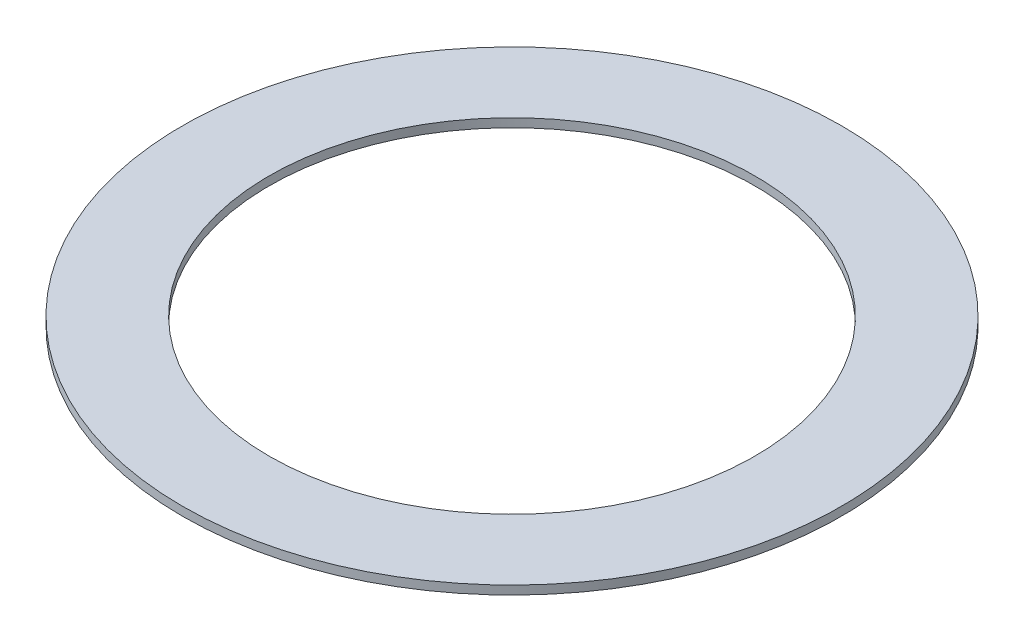
ISO-10303-21;
HEADER;
FILE_DESCRIPTION(('STEP AP214'),'2;1');
FILE_NAME('part.step','',(''),(''),'','','');
FILE_SCHEMA(('AUTOMOTIVE_DESIGN { 1 0 10303 214 1 1 1 1 }'));
ENDSEC;
DATA;
#1=APPLICATION_CONTEXT('core data for automotive mechanical design processes');
#2=APPLICATION_PROTOCOL_DEFINITION('international standard','automotive_design',2000,#1);
#3=PRODUCT_CONTEXT('',#1,'mechanical');
#4=PRODUCT('Part','Part','',(#3));
#5=PRODUCT_RELATED_PRODUCT_CATEGORY('part','',(#4));
#6=PRODUCT_DEFINITION_FORMATION('','',#4);
#7=PRODUCT_DEFINITION_CONTEXT('part definition',#1,'design');
#8=PRODUCT_DEFINITION('design','',#6,#7);
#9=PRODUCT_DEFINITION_SHAPE('','',#8);
#10=(LENGTH_UNIT() NAMED_UNIT(*) SI_UNIT(.MILLI.,.METRE.));
#11=(NAMED_UNIT(*) PLANE_ANGLE_UNIT() SI_UNIT($,.RADIAN.));
#12=(NAMED_UNIT(*) SI_UNIT($,.STERADIAN.) SOLID_ANGLE_UNIT());
#13=UNCERTAINTY_MEASURE_WITH_UNIT(LENGTH_MEASURE(1.E-05),#10,'distance_accuracy_value','');
#14=(GEOMETRIC_REPRESENTATION_CONTEXT(3) GLOBAL_UNCERTAINTY_ASSIGNED_CONTEXT((#13)) GLOBAL_UNIT_ASSIGNED_CONTEXT((#10,
#11,#12)) REPRESENTATION_CONTEXT('',''));
#15=CARTESIAN_POINT('',(0.,0.,0.));
#16=DIRECTION('',(0.,0.,1.));
#17=DIRECTION('',(1.,0.,0.));
#18=AXIS2_PLACEMENT_3D('',#15,#16,#17);
#19=CARTESIAN_POINT('',(0.,3.175,0.));
#20=DIRECTION('',(0.,1.,0.));
#21=DIRECTION('',(0.,0.,1.));
#22=AXIS2_PLACEMENT_3D('',#19,#20,#21);
#23=PLANE('',#22);
#24=CARTESIAN_POINT('',(0.,3.175,0.));
#25=DIRECTION('',(0.,1.,0.));
#26=DIRECTION('',(0.,0.,1.));
#27=AXIS2_PLACEMENT_3D('',#24,#25,#26);
#28=CIRCLE('',#27,120.65);
#29=CARTESIAN_POINT('',(0.,3.175,120.65));
#30=VERTEX_POINT('',#29);
#31=EDGE_CURVE('E10',#30,#30,#28,.T.);
#32=ORIENTED_EDGE('',*,*,#31,.T.);
#33=EDGE_LOOP('',(#32));
#34=FACE_BOUND('',#33,.T.);
#35=CARTESIAN_POINT('',(0.,3.175,0.));
#36=DIRECTION('',(0.,1.,0.));
#37=DIRECTION('',(0.,0.,1.));
#38=AXIS2_PLACEMENT_3D('',#35,#36,#37);
#39=CIRCLE('',#38,88.9);
#40=CARTESIAN_POINT('',(0.,3.175,88.9));
#41=VERTEX_POINT('',#40);
#42=EDGE_CURVE('E50',#41,#41,#39,.T.);
#43=ORIENTED_EDGE('',*,*,#42,.F.);
#44=EDGE_LOOP('',(#43));
#45=FACE_BOUND('',#44,.T.);
#46=ADVANCED_FACE('F37',(#34,#45),#23,.T.);
#47=CARTESIAN_POINT('',(0.,0.,0.));
#48=DIRECTION('',(0.,1.,0.));
#49=DIRECTION('',(0.,0.,1.));
#50=AXIS2_PLACEMENT_3D('',#47,#48,#49);
#51=PLANE('',#50);
#52=CARTESIAN_POINT('',(0.,0.,0.));
#53=DIRECTION('',(0.,1.,0.));
#54=DIRECTION('',(0.,0.,1.));
#55=AXIS2_PLACEMENT_3D('',#52,#53,#54);
#56=CIRCLE('',#55,120.65);
#57=CARTESIAN_POINT('',(0.,0.,120.65));
#58=VERTEX_POINT('',#57);
#59=EDGE_CURVE('E41',#58,#58,#56,.T.);
#60=ORIENTED_EDGE('',*,*,#59,.F.);
#61=EDGE_LOOP('',(#60));
#62=FACE_BOUND('',#61,.T.);
#63=CARTESIAN_POINT('',(0.,0.,0.));
#64=DIRECTION('',(0.,1.,0.));
#65=DIRECTION('',(0.,0.,1.));
#66=AXIS2_PLACEMENT_3D('',#63,#64,#65);
#67=CIRCLE('',#66,88.9);
#68=CARTESIAN_POINT('',(0.,0.,88.9));
#69=VERTEX_POINT('',#68);
#70=EDGE_CURVE('E52',#69,#69,#67,.T.);
#71=ORIENTED_EDGE('',*,*,#70,.T.);
#72=EDGE_LOOP('',(#71));
#73=FACE_BOUND('',#72,.T.);
#74=ADVANCED_FACE('F64',(#62,#73),#51,.F.);
#75=CARTESIAN_POINT('',(0.,3.175,0.));
#76=DIRECTION('',(0.,-1.,0.));
#77=DIRECTION('',(0.,0.,-1.));
#78=AXIS2_PLACEMENT_3D('',#75,#76,#77);
#79=CYLINDRICAL_SURFACE('',#78,120.65);
#80=ORIENTED_EDGE('',*,*,#31,.F.);
#81=EDGE_LOOP('',(#80));
#82=FACE_BOUND('',#81,.T.);
#83=ORIENTED_EDGE('',*,*,#59,.T.);
#84=EDGE_LOOP('',(#83));
#85=FACE_BOUND('',#84,.T.);
#86=ADVANCED_FACE('F39',(#82,#85),#79,.T.);
#87=CARTESIAN_POINT('',(0.,3.175,0.));
#88=DIRECTION('',(0.,-1.,0.));
#89=DIRECTION('',(0.,0.,-1.));
#90=AXIS2_PLACEMENT_3D('',#87,#88,#89);
#91=CYLINDRICAL_SURFACE('',#90,88.9);
#92=ORIENTED_EDGE('',*,*,#42,.T.);
#93=EDGE_LOOP('',(#92));
#94=FACE_BOUND('',#93,.T.);
#95=ORIENTED_EDGE('',*,*,#70,.F.);
#96=EDGE_LOOP('',(#95));
#97=FACE_BOUND('',#96,.T.);
#98=ADVANCED_FACE('F60',(#94,#97),#91,.F.);
#99=CLOSED_SHELL('',(#46,#74,#86,#98));
#100=MANIFOLD_SOLID_BREP('B2',#99);
#101=ADVANCED_BREP_SHAPE_REPRESENTATION('',(#18,#100),#14);
#102=SHAPE_DEFINITION_REPRESENTATION(#9,#101);
ENDSEC;
END-ISO-10303-21;
